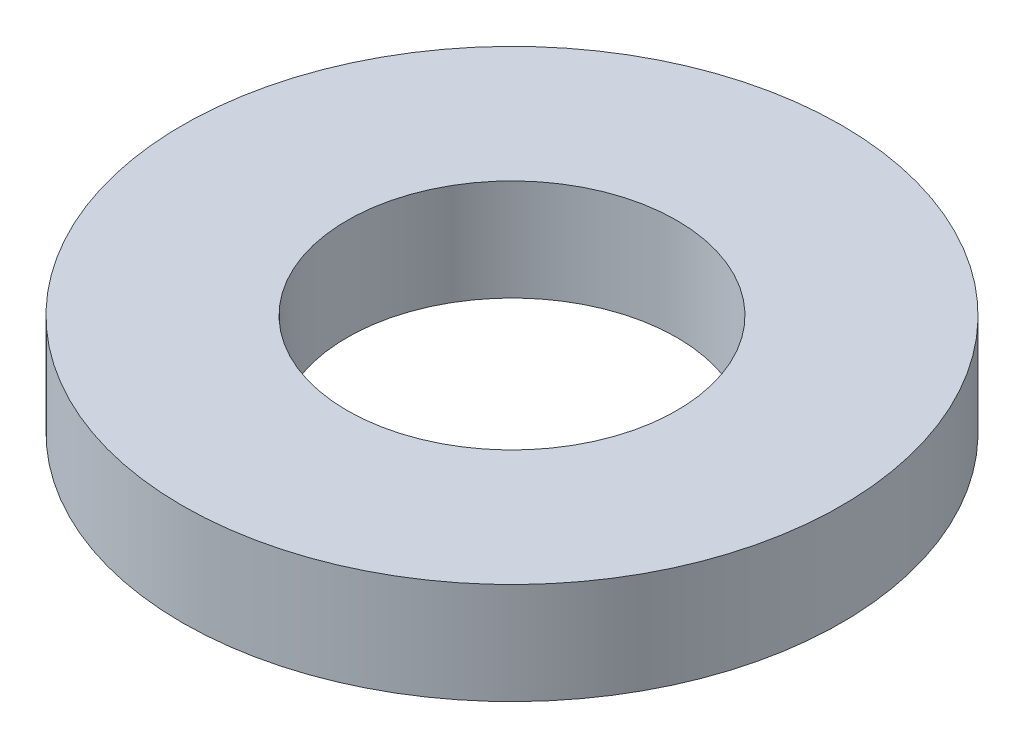
ISO-10303-21;
HEADER;
FILE_DESCRIPTION(('STEP AP214'),'2;1');
FILE_NAME('part.step','',(''),(''),'','','');
FILE_SCHEMA(('AUTOMOTIVE_DESIGN { 1 0 10303 214 1 1 1 1 }'));
ENDSEC;
DATA;
#1=APPLICATION_CONTEXT('core data for automotive mechanical design processes');
#2=APPLICATION_PROTOCOL_DEFINITION('international standard','automotive_design',2000,#1);
#3=PRODUCT_CONTEXT('',#1,'mechanical');
#4=PRODUCT('Part','Part','',(#3));
#5=PRODUCT_RELATED_PRODUCT_CATEGORY('part','',(#4));
#6=PRODUCT_DEFINITION_FORMATION('','',#4);
#7=PRODUCT_DEFINITION_CONTEXT('part definition',#1,'design');
#8=PRODUCT_DEFINITION('design','',#6,#7);
#9=PRODUCT_DEFINITION_SHAPE('','',#8);
#10=(LENGTH_UNIT() NAMED_UNIT(*) SI_UNIT(.MILLI.,.METRE.));
#11=(NAMED_UNIT(*) PLANE_ANGLE_UNIT() SI_UNIT($,.RADIAN.));
#12=(NAMED_UNIT(*) SI_UNIT($,.STERADIAN.) SOLID_ANGLE_UNIT());
#13=UNCERTAINTY_MEASURE_WITH_UNIT(LENGTH_MEASURE(1.E-05),#10,'distance_accuracy_value','');
#14=(GEOMETRIC_REPRESENTATION_CONTEXT(3) GLOBAL_UNCERTAINTY_ASSIGNED_CONTEXT((#13)) GLOBAL_UNIT_ASSIGNED_CONTEXT((#10,
#11,#12)) REPRESENTATION_CONTEXT('',''));
#15=CARTESIAN_POINT('',(0.,0.,0.));
#16=DIRECTION('',(0.,0.,1.));
#17=DIRECTION('',(1.,0.,0.));
#18=AXIS2_PLACEMENT_3D('',#15,#16,#17);
#19=CARTESIAN_POINT('',(0.,20.,0.));
#20=DIRECTION('',(0.,-1.,0.));
#21=DIRECTION('',(0.,0.,-1.));
#22=AXIS2_PLACEMENT_3D('',#19,#20,#21);
#23=CYLINDRICAL_SURFACE('',#22,65.);
#24=CARTESIAN_POINT('',(0.,20.,0.));
#25=DIRECTION('',(0.,1.,0.));
#26=DIRECTION('',(0.,0.,1.));
#27=AXIS2_PLACEMENT_3D('',#24,#25,#26);
#28=CIRCLE('',#27,65.);
#29=CARTESIAN_POINT('',(0.,20.,65.));
#30=VERTEX_POINT('',#29);
#31=EDGE_CURVE('E10',#30,#30,#28,.T.);
#32=ORIENTED_EDGE('',*,*,#31,.F.);
#33=EDGE_LOOP('',(#32));
#34=FACE_BOUND('',#33,.T.);
#35=CARTESIAN_POINT('',(0.,0.,0.));
#36=DIRECTION('',(0.,1.,0.));
#37=DIRECTION('',(0.,0.,1.));
#38=AXIS2_PLACEMENT_3D('',#35,#36,#37);
#39=CIRCLE('',#38,65.);
#40=CARTESIAN_POINT('',(0.,0.,65.));
#41=VERTEX_POINT('',#40);
#42=EDGE_CURVE('E37',#41,#41,#39,.T.);
#43=ORIENTED_EDGE('',*,*,#42,.T.);
#44=EDGE_LOOP('',(#43));
#45=FACE_BOUND('',#44,.T.);
#46=ADVANCED_FACE('F40',(#34,#45),#23,.T.);
#47=CARTESIAN_POINT('',(0.,20.,0.));
#48=DIRECTION('',(0.,1.,0.));
#49=DIRECTION('',(0.,0.,1.));
#50=AXIS2_PLACEMENT_3D('',#47,#48,#49);
#51=PLANE('',#50);
#52=CARTESIAN_POINT('',(0.,20.,0.));
#53=DIRECTION('',(0.,1.,0.));
#54=DIRECTION('',(0.,0.,1.));
#55=AXIS2_PLACEMENT_3D('',#52,#53,#54);
#56=CIRCLE('',#55,32.5);
#57=CARTESIAN_POINT('',(0.,20.,32.5));
#58=VERTEX_POINT('',#57);
#59=EDGE_CURVE('E50',#58,#58,#56,.T.);
#60=ORIENTED_EDGE('',*,*,#59,.F.);
#61=EDGE_LOOP('',(#60));
#62=FACE_BOUND('',#61,.T.);
#63=ORIENTED_EDGE('',*,*,#31,.T.);
#64=EDGE_LOOP('',(#63));
#65=FACE_BOUND('',#64,.T.);
#66=ADVANCED_FACE('F59',(#62,#65),#51,.T.);
#67=CARTESIAN_POINT('',(0.,0.,0.));
#68=DIRECTION('',(0.,1.,0.));
#69=DIRECTION('',(0.,0.,1.));
#70=AXIS2_PLACEMENT_3D('',#67,#68,#69);
#71=PLANE('',#70);
#72=CARTESIAN_POINT('',(0.,0.,0.));
#73=DIRECTION('',(0.,1.,0.));
#74=DIRECTION('',(0.,0.,1.));
#75=AXIS2_PLACEMENT_3D('',#72,#73,#74);
#76=CIRCLE('',#75,32.5);
#77=CARTESIAN_POINT('',(0.,0.,32.5));
#78=VERTEX_POINT('',#77);
#79=EDGE_CURVE('E47',#78,#78,#76,.T.);
#80=ORIENTED_EDGE('',*,*,#79,.T.);
#81=EDGE_LOOP('',(#80));
#82=FACE_BOUND('',#81,.T.);
#83=ORIENTED_EDGE('',*,*,#42,.F.);
#84=EDGE_LOOP('',(#83));
#85=FACE_BOUND('',#84,.T.);
#86=ADVANCED_FACE('F58',(#82,#85),#71,.F.);
#87=CARTESIAN_POINT('',(0.,20.,0.));
#88=DIRECTION('',(0.,-1.,0.));
#89=DIRECTION('',(0.,0.,-1.));
#90=AXIS2_PLACEMENT_3D('',#87,#88,#89);
#91=CYLINDRICAL_SURFACE('',#90,32.5);
#92=ORIENTED_EDGE('',*,*,#59,.T.);
#93=EDGE_LOOP('',(#92));
#94=FACE_BOUND('',#93,.T.);
#95=ORIENTED_EDGE('',*,*,#79,.F.);
#96=EDGE_LOOP('',(#95));
#97=FACE_BOUND('',#96,.T.);
#98=ADVANCED_FACE('F54',(#94,#97),#91,.F.);
#99=CLOSED_SHELL('',(#46,#66,#86,#98));
#100=MANIFOLD_SOLID_BREP('B2',#99);
#101=ADVANCED_BREP_SHAPE_REPRESENTATION('',(#18,#100),#14);
#102=SHAPE_DEFINITION_REPRESENTATION(#9,#101);
ENDSEC;
END-ISO-10303-21;
